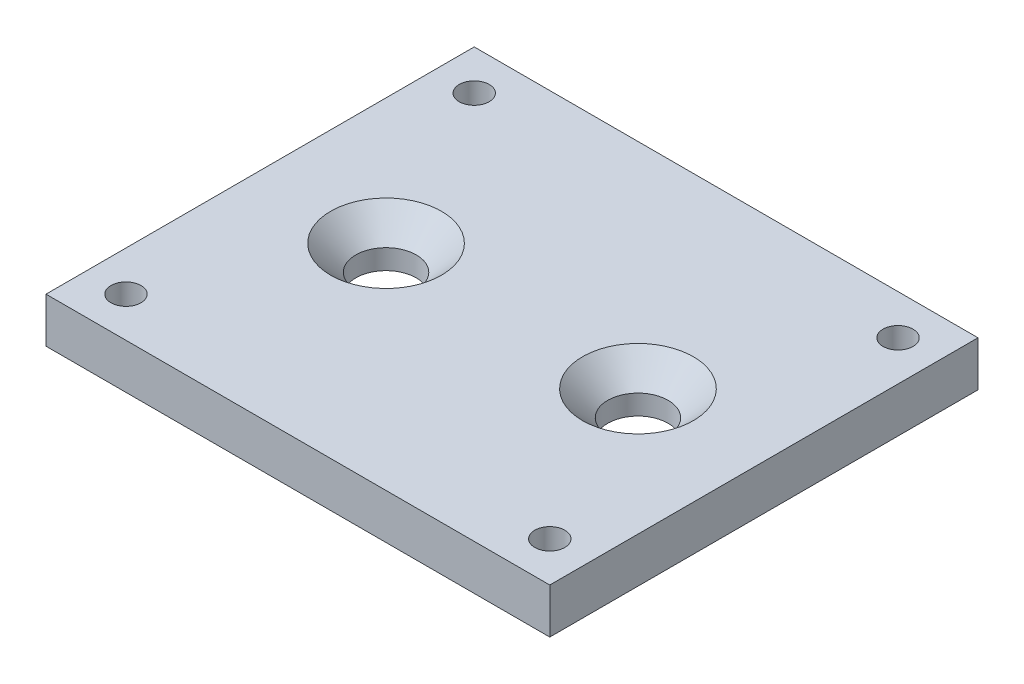
ISO-10303-21;
HEADER;
FILE_DESCRIPTION(('STEP AP214'),'2;1');
FILE_NAME('part.step','',(''),(''),'','','');
FILE_SCHEMA(('AUTOMOTIVE_DESIGN { 1 0 10303 214 1 1 1 1 }'));
ENDSEC;
DATA;
#1=APPLICATION_CONTEXT('core data for automotive mechanical design processes');
#2=APPLICATION_PROTOCOL_DEFINITION('international standard','automotive_design',2000,#1);
#3=PRODUCT_CONTEXT('',#1,'mechanical');
#4=PRODUCT('Part','Part','',(#3));
#5=PRODUCT_RELATED_PRODUCT_CATEGORY('part','',(#4));
#6=PRODUCT_DEFINITION_FORMATION('','',#4);
#7=PRODUCT_DEFINITION_CONTEXT('part definition',#1,'design');
#8=PRODUCT_DEFINITION('design','',#6,#7);
#9=PRODUCT_DEFINITION_SHAPE('','',#8);
#10=(LENGTH_UNIT() NAMED_UNIT(*) SI_UNIT(.MILLI.,.METRE.));
#11=(NAMED_UNIT(*) PLANE_ANGLE_UNIT() SI_UNIT($,.RADIAN.));
#12=(NAMED_UNIT(*) SI_UNIT($,.STERADIAN.) SOLID_ANGLE_UNIT());
#13=UNCERTAINTY_MEASURE_WITH_UNIT(LENGTH_MEASURE(1.E-05),#10,'distance_accuracy_value','');
#14=(GEOMETRIC_REPRESENTATION_CONTEXT(3) GLOBAL_UNCERTAINTY_ASSIGNED_CONTEXT((#13)) GLOBAL_UNIT_ASSIGNED_CONTEXT((#10,
#11,#12)) REPRESENTATION_CONTEXT('',''));
#15=CARTESIAN_POINT('',(0.,0.,0.));
#16=DIRECTION('',(0.,0.,1.));
#17=DIRECTION('',(1.,0.,0.));
#18=AXIS2_PLACEMENT_3D('',#15,#16,#17);
#19=CARTESIAN_POINT('',(10.,1.7907,-8.5));
#20=DIRECTION('',(0.,-1.,0.));
#21=DIRECTION('',(0.,0.,-1.));
#22=AXIS2_PLACEMENT_3D('',#19,#20,#21);
#23=PLANE('',#22);
#24=CARTESIAN_POINT('',(-5.,1.7907,0.));
#25=DIRECTION('',(0.,1.,0.));
#26=DIRECTION('',(0.,0.,1.));
#27=AXIS2_PLACEMENT_3D('',#24,#25,#26);
#28=CIRCLE('',#27,2.2);
#29=CARTESIAN_POINT('',(-5.,1.7907,2.2));
#30=VERTEX_POINT('',#29);
#31=EDGE_CURVE('E148',#30,#30,#28,.T.);
#32=ORIENTED_EDGE('',*,*,#31,.F.);
#33=EDGE_LOOP('',(#32));
#34=FACE_BOUND('',#33,.T.);
#35=DIRECTION('',(0.,0.,-1.));
#36=VECTOR('',#35,1.);
#37=CARTESIAN_POINT('',(10.,1.7907,8.5));
#38=LINE('',#37,#36);
#39=CARTESIAN_POINT('',(10.,1.7907,8.5));
#40=VERTEX_POINT('',#39);
#41=CARTESIAN_POINT('',(10.,1.7907,-8.5));
#42=VERTEX_POINT('',#41);
#43=EDGE_CURVE('E84',#40,#42,#38,.T.);
#44=ORIENTED_EDGE('',*,*,#43,.T.);
#45=DIRECTION('',(-1.,0.,0.));
#46=VECTOR('',#45,1.);
#47=CARTESIAN_POINT('',(-10.,1.7907,-8.5));
#48=LINE('',#47,#46);
#49=CARTESIAN_POINT('',(-10.,1.7907,-8.5));
#50=VERTEX_POINT('',#49);
#51=EDGE_CURVE('E79',#42,#50,#48,.T.);
#52=ORIENTED_EDGE('',*,*,#51,.T.);
#53=DIRECTION('',(0.,0.,1.));
#54=VECTOR('',#53,1.);
#55=CARTESIAN_POINT('',(-10.,1.7907,8.5));
#56=LINE('',#55,#54);
#57=CARTESIAN_POINT('',(-10.,1.7907,8.5));
#58=VERTEX_POINT('',#57);
#59=EDGE_CURVE('E82',#50,#58,#56,.T.);
#60=ORIENTED_EDGE('',*,*,#59,.T.);
#61=DIRECTION('',(1.,0.,0.));
#62=VECTOR('',#61,1.);
#63=CARTESIAN_POINT('',(-10.,1.7907,8.5));
#64=LINE('',#63,#62);
#65=EDGE_CURVE('E49',#58,#40,#64,.T.);
#66=ORIENTED_EDGE('',*,*,#65,.T.);
#67=EDGE_LOOP('',(#44,#52,#60,#66));
#68=FACE_BOUND('',#67,.T.);
#69=CARTESIAN_POINT('',(-8.41249999999999,1.7907,6.9125));
#70=DIRECTION('',(0.,1.,0.));
#71=DIRECTION('',(0.,0.,1.));
#72=AXIS2_PLACEMENT_3D('',#69,#70,#71);
#73=CIRCLE('',#72,0.595629999999988);
#74=CARTESIAN_POINT('',(-8.41249999999999,1.7907,7.50812999999999));
#75=VERTEX_POINT('',#74);
#76=EDGE_CURVE('E112',#75,#75,#73,.T.);
#77=ORIENTED_EDGE('',*,*,#76,.F.);
#78=EDGE_LOOP('',(#77));
#79=FACE_BOUND('',#78,.T.);
#80=CARTESIAN_POINT('',(-8.41249999999999,1.7907,-6.9125));
#81=DIRECTION('',(0.,1.,0.));
#82=DIRECTION('',(0.,0.,1.));
#83=AXIS2_PLACEMENT_3D('',#80,#81,#82);
#84=CIRCLE('',#83,0.595629999999988);
#85=CARTESIAN_POINT('',(-8.41249999999999,1.7907,-6.31687000000001));
#86=VERTEX_POINT('',#85);
#87=EDGE_CURVE('E118',#86,#86,#84,.T.);
#88=ORIENTED_EDGE('',*,*,#87,.F.);
#89=EDGE_LOOP('',(#88));
#90=FACE_BOUND('',#89,.T.);
#91=CARTESIAN_POINT('',(8.41249999999999,1.7907,6.9125));
#92=DIRECTION('',(0.,1.,0.));
#93=DIRECTION('',(0.,0.,1.));
#94=AXIS2_PLACEMENT_3D('',#91,#92,#93);
#95=CIRCLE('',#94,0.595629999999988);
#96=CARTESIAN_POINT('',(8.41249999999999,1.7907,7.50812999999999));
#97=VERTEX_POINT('',#96);
#98=EDGE_CURVE('E124',#97,#97,#95,.T.);
#99=ORIENTED_EDGE('',*,*,#98,.F.);
#100=EDGE_LOOP('',(#99));
#101=FACE_BOUND('',#100,.T.);
#102=CARTESIAN_POINT('',(8.41249999999999,1.7907,-6.9125));
#103=DIRECTION('',(0.,1.,0.));
#104=DIRECTION('',(0.,0.,1.));
#105=AXIS2_PLACEMENT_3D('',#102,#103,#104);
#106=CIRCLE('',#105,0.595629999999988);
#107=CARTESIAN_POINT('',(8.41249999999999,1.7907,-6.31687000000001));
#108=VERTEX_POINT('',#107);
#109=EDGE_CURVE('E130',#108,#108,#106,.T.);
#110=ORIENTED_EDGE('',*,*,#109,.F.);
#111=EDGE_LOOP('',(#110));
#112=FACE_BOUND('',#111,.T.);
#113=CARTESIAN_POINT('',(5.,1.7907,0.));
#114=DIRECTION('',(0.,1.,0.));
#115=DIRECTION('',(0.,0.,1.));
#116=AXIS2_PLACEMENT_3D('',#113,#114,#115);
#117=CIRCLE('',#116,2.2);
#118=CARTESIAN_POINT('',(5.,1.7907,2.2));
#119=VERTEX_POINT('',#118);
#120=EDGE_CURVE('E139',#119,#119,#117,.T.);
#121=ORIENTED_EDGE('',*,*,#120,.F.);
#122=EDGE_LOOP('',(#121));
#123=FACE_BOUND('',#122,.T.);
#124=ADVANCED_FACE('F32',(#34,#68,#79,#90,#101,#112,#123),#23,.F.);
#125=CARTESIAN_POINT('',(10.,1.7907,8.5));
#126=DIRECTION('',(-1.,0.,0.));
#127=DIRECTION('',(0.,0.,1.));
#128=AXIS2_PLACEMENT_3D('',#125,#126,#127);
#129=PLANE('',#128);
#130=DIRECTION('',(0.,0.,-1.));
#131=VECTOR('',#130,1.);
#132=CARTESIAN_POINT('',(10.,0.,8.5));
#133=LINE('',#132,#131);
#134=CARTESIAN_POINT('',(10.,0.,8.5));
#135=VERTEX_POINT('',#134);
#136=CARTESIAN_POINT('',(10.,0.,-8.5));
#137=VERTEX_POINT('',#136);
#138=EDGE_CURVE('E96',#135,#137,#133,.T.);
#139=ORIENTED_EDGE('',*,*,#138,.T.);
#140=DIRECTION('',(0.,-1.,0.));
#141=VECTOR('',#140,1.);
#142=CARTESIAN_POINT('',(10.,1.7907,-8.5));
#143=LINE('',#142,#141);
#144=EDGE_CURVE('E11',#42,#137,#143,.T.);
#145=ORIENTED_EDGE('',*,*,#144,.F.);
#146=ORIENTED_EDGE('',*,*,#43,.F.);
#147=DIRECTION('',(0.,-1.,0.));
#148=VECTOR('',#147,1.);
#149=CARTESIAN_POINT('',(10.,1.7907,8.5));
#150=LINE('',#149,#148);
#151=EDGE_CURVE('E92',#40,#135,#150,.T.);
#152=ORIENTED_EDGE('',*,*,#151,.T.);
#153=EDGE_LOOP('',(#139,#145,#146,#152));
#154=FACE_BOUND('',#153,.T.);
#155=ADVANCED_FACE('F34',(#154),#129,.F.);
#156=CARTESIAN_POINT('',(-10.,1.7907,-8.5));
#157=DIRECTION('',(0.,0.,1.));
#158=DIRECTION('',(1.,0.,0.));
#159=AXIS2_PLACEMENT_3D('',#156,#157,#158);
#160=PLANE('',#159);
#161=DIRECTION('',(-1.,0.,0.));
#162=VECTOR('',#161,1.);
#163=CARTESIAN_POINT('',(-10.,0.,-8.5));
#164=LINE('',#163,#162);
#165=CARTESIAN_POINT('',(-10.,0.,-8.5));
#166=VERTEX_POINT('',#165);
#167=EDGE_CURVE('E88',#137,#166,#164,.T.);
#168=ORIENTED_EDGE('',*,*,#167,.T.);
#169=DIRECTION('',(0.,-1.,0.));
#170=VECTOR('',#169,1.);
#171=CARTESIAN_POINT('',(-10.,1.7907,-8.5));
#172=LINE('',#171,#170);
#173=EDGE_CURVE('E41',#50,#166,#172,.T.);
#174=ORIENTED_EDGE('',*,*,#173,.F.);
#175=ORIENTED_EDGE('',*,*,#51,.F.);
#176=ORIENTED_EDGE('',*,*,#144,.T.);
#177=EDGE_LOOP('',(#168,#174,#175,#176));
#178=FACE_BOUND('',#177,.T.);
#179=ADVANCED_FACE('F87',(#178),#160,.F.);
#180=CARTESIAN_POINT('',(-10.,1.7907,8.5));
#181=DIRECTION('',(1.,0.,0.));
#182=DIRECTION('',(0.,0.,-1.));
#183=AXIS2_PLACEMENT_3D('',#180,#181,#182);
#184=PLANE('',#183);
#185=DIRECTION('',(0.,0.,1.));
#186=VECTOR('',#185,1.);
#187=CARTESIAN_POINT('',(-10.,0.,8.5));
#188=LINE('',#187,#186);
#189=CARTESIAN_POINT('',(-10.,0.,8.5));
#190=VERTEX_POINT('',#189);
#191=EDGE_CURVE('E66',#166,#190,#188,.T.);
#192=ORIENTED_EDGE('',*,*,#191,.T.);
#193=DIRECTION('',(0.,-1.,0.));
#194=VECTOR('',#193,1.);
#195=CARTESIAN_POINT('',(-10.,1.7907,8.5));
#196=LINE('',#195,#194);
#197=EDGE_CURVE('E89',#58,#190,#196,.T.);
#198=ORIENTED_EDGE('',*,*,#197,.F.);
#199=ORIENTED_EDGE('',*,*,#59,.F.);
#200=ORIENTED_EDGE('',*,*,#173,.T.);
#201=EDGE_LOOP('',(#192,#198,#199,#200));
#202=FACE_BOUND('',#201,.T.);
#203=ADVANCED_FACE('F90',(#202),#184,.F.);
#204=CARTESIAN_POINT('',(-10.,1.7907,8.5));
#205=DIRECTION('',(0.,0.,-1.));
#206=DIRECTION('',(-1.,0.,0.));
#207=AXIS2_PLACEMENT_3D('',#204,#205,#206);
#208=PLANE('',#207);
#209=DIRECTION('',(1.,0.,0.));
#210=VECTOR('',#209,1.);
#211=CARTESIAN_POINT('',(-10.,0.,8.5));
#212=LINE('',#211,#210);
#213=EDGE_CURVE('E72',#190,#135,#212,.T.);
#214=ORIENTED_EDGE('',*,*,#213,.T.);
#215=ORIENTED_EDGE('',*,*,#151,.F.);
#216=ORIENTED_EDGE('',*,*,#65,.F.);
#217=ORIENTED_EDGE('',*,*,#197,.T.);
#218=EDGE_LOOP('',(#214,#215,#216,#217));
#219=FACE_BOUND('',#218,.T.);
#220=ADVANCED_FACE('F104',(#219),#208,.F.);
#221=CARTESIAN_POINT('',(10.,0.,-8.5));
#222=DIRECTION('',(0.,-1.,0.));
#223=DIRECTION('',(0.,0.,-1.));
#224=AXIS2_PLACEMENT_3D('',#221,#222,#223);
#225=PLANE('',#224);
#226=CARTESIAN_POINT('',(-5.,0.,0.));
#227=DIRECTION('',(0.,1.,0.));
#228=DIRECTION('',(0.,0.,1.));
#229=AXIS2_PLACEMENT_3D('',#226,#227,#228);
#230=CIRCLE('',#229,1.2);
#231=CARTESIAN_POINT('',(-5.,0.,1.2));
#232=VERTEX_POINT('',#231);
#233=EDGE_CURVE('E142',#232,#232,#230,.T.);
#234=ORIENTED_EDGE('',*,*,#233,.T.);
#235=EDGE_LOOP('',(#234));
#236=FACE_BOUND('',#235,.T.);
#237=CARTESIAN_POINT('',(5.,0.,0.));
#238=DIRECTION('',(0.,1.,0.));
#239=DIRECTION('',(0.,0.,1.));
#240=AXIS2_PLACEMENT_3D('',#237,#238,#239);
#241=CIRCLE('',#240,1.2);
#242=CARTESIAN_POINT('',(5.,0.,1.2));
#243=VERTEX_POINT('',#242);
#244=EDGE_CURVE('E133',#243,#243,#241,.T.);
#245=ORIENTED_EDGE('',*,*,#244,.T.);
#246=EDGE_LOOP('',(#245));
#247=FACE_BOUND('',#246,.T.);
#248=CARTESIAN_POINT('',(8.41249999999999,0.,-6.9125));
#249=DIRECTION('',(0.,1.,0.));
#250=DIRECTION('',(0.,0.,1.));
#251=AXIS2_PLACEMENT_3D('',#248,#249,#250);
#252=CIRCLE('',#251,0.59563);
#253=CARTESIAN_POINT('',(8.41249999999999,0.,-6.31687));
#254=VERTEX_POINT('',#253);
#255=EDGE_CURVE('E127',#254,#254,#252,.T.);
#256=ORIENTED_EDGE('',*,*,#255,.T.);
#257=EDGE_LOOP('',(#256));
#258=FACE_BOUND('',#257,.T.);
#259=CARTESIAN_POINT('',(8.41249999999999,0.,6.9125));
#260=DIRECTION('',(0.,1.,0.));
#261=DIRECTION('',(0.,0.,1.));
#262=AXIS2_PLACEMENT_3D('',#259,#260,#261);
#263=CIRCLE('',#262,0.59563);
#264=CARTESIAN_POINT('',(8.41249999999999,0.,7.50813));
#265=VERTEX_POINT('',#264);
#266=EDGE_CURVE('E121',#265,#265,#263,.T.);
#267=ORIENTED_EDGE('',*,*,#266,.T.);
#268=EDGE_LOOP('',(#267));
#269=FACE_BOUND('',#268,.T.);
#270=CARTESIAN_POINT('',(-8.41249999999999,0.,-6.9125));
#271=DIRECTION('',(0.,1.,0.));
#272=DIRECTION('',(0.,0.,1.));
#273=AXIS2_PLACEMENT_3D('',#270,#271,#272);
#274=CIRCLE('',#273,0.59563);
#275=CARTESIAN_POINT('',(-8.41249999999999,0.,-6.31687));
#276=VERTEX_POINT('',#275);
#277=EDGE_CURVE('E115',#276,#276,#274,.T.);
#278=ORIENTED_EDGE('',*,*,#277,.T.);
#279=EDGE_LOOP('',(#278));
#280=FACE_BOUND('',#279,.T.);
#281=CARTESIAN_POINT('',(-8.41249999999999,0.,6.9125));
#282=DIRECTION('',(0.,1.,0.));
#283=DIRECTION('',(0.,0.,1.));
#284=AXIS2_PLACEMENT_3D('',#281,#282,#283);
#285=CIRCLE('',#284,0.59563);
#286=CARTESIAN_POINT('',(-8.41249999999999,0.,7.50813));
#287=VERTEX_POINT('',#286);
#288=EDGE_CURVE('E99',#287,#287,#285,.T.);
#289=ORIENTED_EDGE('',*,*,#288,.T.);
#290=EDGE_LOOP('',(#289));
#291=FACE_BOUND('',#290,.T.);
#292=ORIENTED_EDGE('',*,*,#138,.F.);
#293=ORIENTED_EDGE('',*,*,#213,.F.);
#294=ORIENTED_EDGE('',*,*,#191,.F.);
#295=ORIENTED_EDGE('',*,*,#167,.F.);
#296=EDGE_LOOP('',(#292,#293,#294,#295));
#297=FACE_BOUND('',#296,.T.);
#298=ADVANCED_FACE('F107',(#236,#247,#258,#269,#280,#291,#297),#225,.T.);
#299=CARTESIAN_POINT('',(-8.41249999999999,1.7907,6.9125));
#300=DIRECTION('',(0.,1.,0.));
#301=DIRECTION('',(0.,0.,1.));
#302=AXIS2_PLACEMENT_3D('',#299,#300,#301);
#303=CYLINDRICAL_SURFACE('',#302,0.595629999999994);
#304=ORIENTED_EDGE('',*,*,#288,.F.);
#305=EDGE_LOOP('',(#304));
#306=FACE_BOUND('',#305,.T.);
#307=ORIENTED_EDGE('',*,*,#76,.T.);
#308=EDGE_LOOP('',(#307));
#309=FACE_BOUND('',#308,.T.);
#310=ADVANCED_FACE('F161',(#306,#309),#303,.F.);
#311=CARTESIAN_POINT('',(-8.41249999999999,1.7907,-6.9125));
#312=DIRECTION('',(0.,1.,0.));
#313=DIRECTION('',(0.,0.,1.));
#314=AXIS2_PLACEMENT_3D('',#311,#312,#313);
#315=CYLINDRICAL_SURFACE('',#314,0.595629999999994);
#316=ORIENTED_EDGE('',*,*,#277,.F.);
#317=EDGE_LOOP('',(#316));
#318=FACE_BOUND('',#317,.T.);
#319=ORIENTED_EDGE('',*,*,#87,.T.);
#320=EDGE_LOOP('',(#319));
#321=FACE_BOUND('',#320,.T.);
#322=ADVANCED_FACE('F193',(#318,#321),#315,.F.);
#323=CARTESIAN_POINT('',(8.41249999999999,1.7907,6.9125));
#324=DIRECTION('',(0.,1.,0.));
#325=DIRECTION('',(0.,0.,1.));
#326=AXIS2_PLACEMENT_3D('',#323,#324,#325);
#327=CYLINDRICAL_SURFACE('',#326,0.595629999999994);
#328=ORIENTED_EDGE('',*,*,#266,.F.);
#329=EDGE_LOOP('',(#328));
#330=FACE_BOUND('',#329,.T.);
#331=ORIENTED_EDGE('',*,*,#98,.T.);
#332=EDGE_LOOP('',(#331));
#333=FACE_BOUND('',#332,.T.);
#334=ADVANCED_FACE('F200',(#330,#333),#327,.F.);
#335=CARTESIAN_POINT('',(8.41249999999999,1.7907,-6.9125));
#336=DIRECTION('',(0.,1.,0.));
#337=DIRECTION('',(0.,0.,1.));
#338=AXIS2_PLACEMENT_3D('',#335,#336,#337);
#339=CYLINDRICAL_SURFACE('',#338,0.595629999999994);
#340=ORIENTED_EDGE('',*,*,#255,.F.);
#341=EDGE_LOOP('',(#340));
#342=FACE_BOUND('',#341,.T.);
#343=ORIENTED_EDGE('',*,*,#109,.T.);
#344=EDGE_LOOP('',(#343));
#345=FACE_BOUND('',#344,.T.);
#346=ADVANCED_FACE('F207',(#342,#345),#339,.F.);
#347=CARTESIAN_POINT('',(5.,1.7907,0.));
#348=DIRECTION('',(0.,1.,0.));
#349=DIRECTION('',(0.,0.,1.));
#350=AXIS2_PLACEMENT_3D('',#347,#348,#349);
#351=CYLINDRICAL_SURFACE('',#350,1.2);
#352=ORIENTED_EDGE('',*,*,#244,.F.);
#353=EDGE_LOOP('',(#352));
#354=FACE_BOUND('',#353,.T.);
#355=CARTESIAN_POINT('',(5.,0.790699999999998,0.));
#356=DIRECTION('',(0.,1.,0.));
#357=DIRECTION('',(0.,0.,1.));
#358=AXIS2_PLACEMENT_3D('',#355,#356,#357);
#359=CIRCLE('',#358,1.2);
#360=CARTESIAN_POINT('',(5.,0.790699999999998,1.2));
#361=VERTEX_POINT('',#360);
#362=EDGE_CURVE('E136',#361,#361,#359,.T.);
#363=ORIENTED_EDGE('',*,*,#362,.T.);
#364=EDGE_LOOP('',(#363));
#365=FACE_BOUND('',#364,.T.);
#366=ADVANCED_FACE('F215',(#354,#365),#351,.F.);
#367=CARTESIAN_POINT('',(5.,1.7907,0.));
#368=DIRECTION('',(0.,1.,0.));
#369=DIRECTION('',(0.,0.,1.));
#370=AXIS2_PLACEMENT_3D('',#367,#368,#369);
#371=CONICAL_SURFACE('',#370,2.2,0.785398163397447);
#372=ORIENTED_EDGE('',*,*,#362,.F.);
#373=EDGE_LOOP('',(#372));
#374=FACE_BOUND('',#373,.T.);
#375=ORIENTED_EDGE('',*,*,#120,.T.);
#376=EDGE_LOOP('',(#375));
#377=FACE_BOUND('',#376,.T.);
#378=ADVANCED_FACE('F222',(#374,#377),#371,.F.);
#379=CARTESIAN_POINT('',(-5.,1.7907,0.));
#380=DIRECTION('',(0.,1.,0.));
#381=DIRECTION('',(0.,0.,1.));
#382=AXIS2_PLACEMENT_3D('',#379,#380,#381);
#383=CYLINDRICAL_SURFACE('',#382,1.2);
#384=ORIENTED_EDGE('',*,*,#233,.F.);
#385=EDGE_LOOP('',(#384));
#386=FACE_BOUND('',#385,.T.);
#387=CARTESIAN_POINT('',(-5.,0.790699999999998,0.));
#388=DIRECTION('',(0.,1.,0.));
#389=DIRECTION('',(0.,0.,1.));
#390=AXIS2_PLACEMENT_3D('',#387,#388,#389);
#391=CIRCLE('',#390,1.2);
#392=CARTESIAN_POINT('',(-5.,0.790699999999998,1.2));
#393=VERTEX_POINT('',#392);
#394=EDGE_CURVE('E145',#393,#393,#391,.T.);
#395=ORIENTED_EDGE('',*,*,#394,.T.);
#396=EDGE_LOOP('',(#395));
#397=FACE_BOUND('',#396,.T.);
#398=ADVANCED_FACE('F230',(#386,#397),#383,.F.);
#399=CARTESIAN_POINT('',(-5.,1.7907,0.));
#400=DIRECTION('',(0.,1.,0.));
#401=DIRECTION('',(0.,0.,1.));
#402=AXIS2_PLACEMENT_3D('',#399,#400,#401);
#403=CONICAL_SURFACE('',#402,2.2,0.785398163397448);
#404=ORIENTED_EDGE('',*,*,#394,.F.);
#405=EDGE_LOOP('',(#404));
#406=FACE_BOUND('',#405,.T.);
#407=ORIENTED_EDGE('',*,*,#31,.T.);
#408=EDGE_LOOP('',(#407));
#409=FACE_BOUND('',#408,.T.);
#410=ADVANCED_FACE('F152',(#406,#409),#403,.F.);
#411=CLOSED_SHELL('',(#124,#155,#179,#203,#220,#298,#310,#322,#334,#346,#366,#378,#398,#410));
#412=MANIFOLD_SOLID_BREP('B2',#411);
#413=ADVANCED_BREP_SHAPE_REPRESENTATION('',(#18,#412),#14);
#414=SHAPE_DEFINITION_REPRESENTATION(#9,#413);
ENDSEC;
END-ISO-10303-21;
